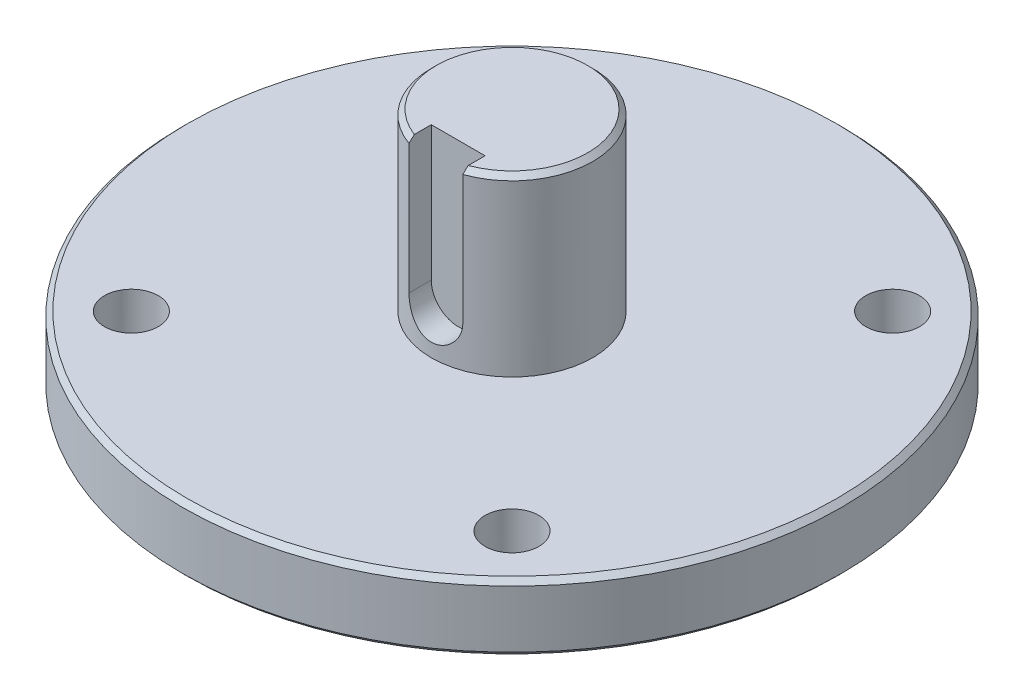
ISO-10303-21;
HEADER;
FILE_DESCRIPTION(('STEP AP214'),'2;1');
FILE_NAME('part.step','',(''),(''),'','','');
FILE_SCHEMA(('AUTOMOTIVE_DESIGN { 1 0 10303 214 1 1 1 1 }'));
ENDSEC;
DATA;
#1=APPLICATION_CONTEXT('core data for automotive mechanical design processes');
#2=APPLICATION_PROTOCOL_DEFINITION('international standard','automotive_design',2000,#1);
#3=PRODUCT_CONTEXT('',#1,'mechanical');
#4=PRODUCT('Part','Part','',(#3));
#5=PRODUCT_RELATED_PRODUCT_CATEGORY('part','',(#4));
#6=PRODUCT_DEFINITION_FORMATION('','',#4);
#7=PRODUCT_DEFINITION_CONTEXT('part definition',#1,'design');
#8=PRODUCT_DEFINITION('design','',#6,#7);
#9=PRODUCT_DEFINITION_SHAPE('','',#8);
#10=(LENGTH_UNIT() NAMED_UNIT(*) SI_UNIT(.MILLI.,.METRE.));
#11=(NAMED_UNIT(*) PLANE_ANGLE_UNIT() SI_UNIT($,.RADIAN.));
#12=(NAMED_UNIT(*) SI_UNIT($,.STERADIAN.) SOLID_ANGLE_UNIT());
#13=UNCERTAINTY_MEASURE_WITH_UNIT(LENGTH_MEASURE(1.E-05),#10,'distance_accuracy_value','');
#14=(GEOMETRIC_REPRESENTATION_CONTEXT(3) GLOBAL_UNCERTAINTY_ASSIGNED_CONTEXT((#13)) GLOBAL_UNIT_ASSIGNED_CONTEXT((#10,
#11,#12)) REPRESENTATION_CONTEXT('',''));
#15=CARTESIAN_POINT('',(0.,0.,0.));
#16=DIRECTION('',(0.,0.,1.));
#17=DIRECTION('',(1.,0.,0.));
#18=AXIS2_PLACEMENT_3D('',#15,#16,#17);
#19=CARTESIAN_POINT('',(0.,0.,0.));
#20=DIRECTION('',(0.,-1.,0.));
#21=DIRECTION('',(0.,0.,-1.));
#22=AXIS2_PLACEMENT_3D('',#19,#20,#21);
#23=PLANE('',#22);
#24=CARTESIAN_POINT('',(0.,0.,0.));
#25=DIRECTION('',(0.,-1.,0.));
#26=DIRECTION('',(0.,0.,-1.));
#27=AXIS2_PLACEMENT_3D('',#24,#25,#26);
#28=CIRCLE('',#27,48.25);
#29=CARTESIAN_POINT('',(0.,0.,-48.25));
#30=VERTEX_POINT('',#29);
#31=EDGE_CURVE('E42',#30,#30,#28,.T.);
#32=ORIENTED_EDGE('',*,*,#31,.T.);
#33=EDGE_LOOP('',(#32));
#34=FACE_BOUND('',#33,.T.);
#35=CARTESIAN_POINT('',(-28.2842712474619,0.,28.2842712474619));
#36=DIRECTION('',(0.,-1.,0.));
#37=DIRECTION('',(0.,0.,-1.));
#38=AXIS2_PLACEMENT_3D('',#35,#36,#37);
#39=CIRCLE('',#38,4.);
#40=CARTESIAN_POINT('',(-28.2842712474619,0.,24.2842712474619));
#41=VERTEX_POINT('',#40);
#42=EDGE_CURVE('E116',#41,#41,#39,.F.);
#43=ORIENTED_EDGE('',*,*,#42,.T.);
#44=EDGE_LOOP('',(#43));
#45=FACE_BOUND('',#44,.T.);
#46=CARTESIAN_POINT('',(28.2842712474619,0.,28.2842712474619));
#47=DIRECTION('',(0.,-1.,0.));
#48=DIRECTION('',(0.,0.,-1.));
#49=AXIS2_PLACEMENT_3D('',#46,#47,#48);
#50=CIRCLE('',#49,4.00000000000001);
#51=CARTESIAN_POINT('',(28.2842712474619,0.,24.2842712474619));
#52=VERTEX_POINT('',#51);
#53=EDGE_CURVE('E127',#52,#52,#50,.F.);
#54=ORIENTED_EDGE('',*,*,#53,.T.);
#55=EDGE_LOOP('',(#54));
#56=FACE_BOUND('',#55,.T.);
#57=CARTESIAN_POINT('',(28.2842712474619,0.,-28.2842712474619));
#58=DIRECTION('',(0.,-1.,0.));
#59=DIRECTION('',(0.,0.,-1.));
#60=AXIS2_PLACEMENT_3D('',#57,#58,#59);
#61=CIRCLE('',#60,4.00000000000001);
#62=CARTESIAN_POINT('',(28.2842712474619,0.,-32.2842712474619));
#63=VERTEX_POINT('',#62);
#64=EDGE_CURVE('E121',#63,#63,#61,.F.);
#65=ORIENTED_EDGE('',*,*,#64,.T.);
#66=EDGE_LOOP('',(#65));
#67=FACE_BOUND('',#66,.T.);
#68=CARTESIAN_POINT('',(-28.2842712474619,0.,-28.2842712474619));
#69=DIRECTION('',(0.,-1.,0.));
#70=DIRECTION('',(0.,0.,-1.));
#71=AXIS2_PLACEMENT_3D('',#68,#69,#70);
#72=CIRCLE('',#71,4.);
#73=CARTESIAN_POINT('',(-28.2842712474619,0.,-32.2842712474619));
#74=VERTEX_POINT('',#73);
#75=EDGE_CURVE('E120',#74,#74,#72,.F.);
#76=ORIENTED_EDGE('',*,*,#75,.T.);
#77=EDGE_LOOP('',(#76));
#78=FACE_BOUND('',#77,.T.);
#79=ADVANCED_FACE('F34',(#34,#45,#56,#67,#78),#23,.T.);
#80=CARTESIAN_POINT('',(0.,36.,0.));
#81=DIRECTION('',(0.,1.,0.));
#82=DIRECTION('',(0.,0.,1.));
#83=AXIS2_PLACEMENT_3D('',#80,#81,#82);
#84=CYLINDRICAL_SURFACE('',#83,49.);
#85=CARTESIAN_POINT('',(0.,0.749999999999987,0.));
#86=DIRECTION('',(0.,-1.,0.));
#87=DIRECTION('',(0.,0.,-1.));
#88=AXIS2_PLACEMENT_3D('',#85,#86,#87);
#89=CIRCLE('',#88,49.);
#90=CARTESIAN_POINT('',(0.,0.749999999999987,-49.));
#91=VERTEX_POINT('',#90);
#92=EDGE_CURVE('E192',#91,#91,#89,.F.);
#93=ORIENTED_EDGE('',*,*,#92,.T.);
#94=EDGE_LOOP('',(#93));
#95=FACE_BOUND('',#94,.T.);
#96=CARTESIAN_POINT('',(0.,9.25000000000002,0.));
#97=DIRECTION('',(0.,1.,0.));
#98=DIRECTION('',(0.,0.,1.));
#99=AXIS2_PLACEMENT_3D('',#96,#97,#98);
#100=CIRCLE('',#99,49.);
#101=CARTESIAN_POINT('',(0.,9.25000000000002,49.));
#102=VERTEX_POINT('',#101);
#103=EDGE_CURVE('E189',#102,#102,#100,.F.);
#104=ORIENTED_EDGE('',*,*,#103,.T.);
#105=EDGE_LOOP('',(#104));
#106=FACE_BOUND('',#105,.T.);
#107=ADVANCED_FACE('F203',(#95,#106),#84,.T.);
#108=CARTESIAN_POINT('',(-49.,10.,0.));
#109=DIRECTION('',(0.,1.,0.));
#110=DIRECTION('',(0.,0.,1.));
#111=AXIS2_PLACEMENT_3D('',#108,#109,#110);
#112=PLANE('',#111);
#113=CARTESIAN_POINT('',(0.,10.,0.));
#114=DIRECTION('',(0.,1.,0.));
#115=DIRECTION('',(0.,0.,1.));
#116=AXIS2_PLACEMENT_3D('',#113,#114,#115);
#117=CIRCLE('',#116,48.25);
#118=CARTESIAN_POINT('',(0.,10.,48.25));
#119=VERTEX_POINT('',#118);
#120=EDGE_CURVE('E11',#119,#119,#117,.T.);
#121=ORIENTED_EDGE('',*,*,#120,.T.);
#122=EDGE_LOOP('',(#121));
#123=FACE_BOUND('',#122,.T.);
#124=CARTESIAN_POINT('',(-28.2842712474619,10.,28.2842712474619));
#125=DIRECTION('',(0.,1.,0.));
#126=DIRECTION('',(0.,0.,1.));
#127=AXIS2_PLACEMENT_3D('',#124,#125,#126);
#128=CIRCLE('',#127,4.);
#129=CARTESIAN_POINT('',(-28.2842712474619,10.,32.2842712474619));
#130=VERTEX_POINT('',#129);
#131=EDGE_CURVE('E130',#130,#130,#128,.T.);
#132=ORIENTED_EDGE('',*,*,#131,.F.);
#133=EDGE_LOOP('',(#132));
#134=FACE_BOUND('',#133,.T.);
#135=CARTESIAN_POINT('',(28.2842712474619,10.,28.2842712474619));
#136=DIRECTION('',(0.,1.,0.));
#137=DIRECTION('',(0.,0.,1.));
#138=AXIS2_PLACEMENT_3D('',#135,#136,#137);
#139=CIRCLE('',#138,4.00000000000001);
#140=CARTESIAN_POINT('',(28.2842712474619,10.,32.2842712474619));
#141=VERTEX_POINT('',#140);
#142=EDGE_CURVE('E124',#141,#141,#139,.T.);
#143=ORIENTED_EDGE('',*,*,#142,.F.);
#144=EDGE_LOOP('',(#143));
#145=FACE_BOUND('',#144,.T.);
#146=CARTESIAN_POINT('',(28.2842712474619,10.,-28.2842712474619));
#147=DIRECTION('',(0.,1.,0.));
#148=DIRECTION('',(0.,0.,1.));
#149=AXIS2_PLACEMENT_3D('',#146,#147,#148);
#150=CIRCLE('',#149,4.00000000000001);
#151=CARTESIAN_POINT('',(28.2842712474619,10.,-24.2842712474619));
#152=VERTEX_POINT('',#151);
#153=EDGE_CURVE('E117',#152,#152,#150,.T.);
#154=ORIENTED_EDGE('',*,*,#153,.F.);
#155=EDGE_LOOP('',(#154));
#156=FACE_BOUND('',#155,.T.);
#157=CARTESIAN_POINT('',(-28.2842712474619,10.,-28.2842712474619));
#158=DIRECTION('',(0.,1.,0.));
#159=DIRECTION('',(0.,0.,1.));
#160=AXIS2_PLACEMENT_3D('',#157,#158,#159);
#161=CIRCLE('',#160,4.);
#162=CARTESIAN_POINT('',(-28.2842712474619,10.,-24.2842712474619));
#163=VERTEX_POINT('',#162);
#164=EDGE_CURVE('E135',#163,#163,#161,.T.);
#165=ORIENTED_EDGE('',*,*,#164,.F.);
#166=EDGE_LOOP('',(#165));
#167=FACE_BOUND('',#166,.T.);
#168=CARTESIAN_POINT('',(0.,10.,0.));
#169=DIRECTION('',(0.,1.,0.));
#170=DIRECTION('',(0.,0.,1.));
#171=AXIS2_PLACEMENT_3D('',#168,#169,#170);
#172=CIRCLE('',#171,12.);
#173=CARTESIAN_POINT('',(0.,10.,12.));
#174=VERTEX_POINT('',#173);
#175=EDGE_CURVE('E138',#174,#174,#172,.T.);
#176=ORIENTED_EDGE('',*,*,#175,.F.);
#177=EDGE_LOOP('',(#176));
#178=FACE_BOUND('',#177,.T.);
#179=ADVANCED_FACE('F206',(#123,#134,#145,#156,#167,#178),#112,.T.);
#180=CARTESIAN_POINT('',(0.,36.,0.));
#181=DIRECTION('',(0.,1.,0.));
#182=DIRECTION('',(0.,0.,1.));
#183=AXIS2_PLACEMENT_3D('',#180,#181,#182);
#184=CYLINDRICAL_SURFACE('',#183,12.);
#185=DIRECTION('',(0.,1.,0.));
#186=VECTOR('',#185,1.);
#187=CARTESIAN_POINT('',(-4.,36.,11.3137084989848));
#188=LINE('',#187,#186);
#189=CARTESIAN_POINT('',(-4.,35.25,11.3137084989848));
#190=VERTEX_POINT('',#189);
#191=CARTESIAN_POINT('',(-3.99999999999998,16.,11.3137084989848));
#192=VERTEX_POINT('',#191);
#193=EDGE_CURVE('E112',#190,#192,#188,.F.);
#194=ORIENTED_EDGE('',*,*,#193,.F.);
#195=CARTESIAN_POINT('',(0.,35.25,0.));
#196=DIRECTION('',(0.,1.,0.));
#197=DIRECTION('',(0.,0.,1.));
#198=AXIS2_PLACEMENT_3D('',#195,#196,#197);
#199=CIRCLE('',#198,12.);
#200=CARTESIAN_POINT('',(4.,35.25,11.3137084989848));
#201=VERTEX_POINT('',#200);
#202=EDGE_CURVE('E49',#190,#201,#199,.F.);
#203=ORIENTED_EDGE('',*,*,#202,.T.);
#204=DIRECTION('',(0.,1.,0.));
#205=VECTOR('',#204,1.);
#206=CARTESIAN_POINT('',(4.,36.,11.3137084989848));
#207=LINE('',#206,#205);
#208=CARTESIAN_POINT('',(4.00000000000001,16.,11.3137084989848));
#209=VERTEX_POINT('',#208);
#210=EDGE_CURVE('E114',#209,#201,#207,.T.);
#211=ORIENTED_EDGE('',*,*,#210,.F.);
#212=CARTESIAN_POINT('',(-3.99999999999997,16.,11.3137084989848));
#213=CARTESIAN_POINT('',(-4.00001438576648,15.8908686754875,11.3136910923705));
#214=CARTESIAN_POINT('',(-3.99553419554534,15.7817470805194,11.3152871024731));
#215=CARTESIAN_POINT('',(-3.97769673248749,15.5643503386412,11.3215763859361));
#216=CARTESIAN_POINT('',(-3.96434185595519,15.4560749712191,11.3262688232103));
#217=CARTESIAN_POINT('',(-3.92891935076471,15.2414552186327,11.3386032840401));
#218=CARTESIAN_POINT('',(-3.90687756421019,15.1351060759185,11.3462365576019));
#219=CARTESIAN_POINT('',(-3.85430689648185,14.9247867702676,11.364201918496));
#220=CARTESIAN_POINT('',(-3.82377770857631,14.8208166934565,11.3745341033653));
#221=CARTESIAN_POINT('',(-3.71986482089945,14.5136614724559,11.4091190527027));
#222=CARTESIAN_POINT('',(-3.63410266896584,14.314913348044,11.4369799021453));
#223=CARTESIAN_POINT('',(-3.43228454569817,13.9345971016626,11.4991525453999));
#224=CARTESIAN_POINT('',(-3.31620997228934,13.753039622767,11.5334682968154));
#225=CARTESIAN_POINT('',(-3.05220793355646,13.4051313544309,11.6061789182336));
#226=CARTESIAN_POINT('',(-2.90330055412138,13.2395437715106,11.6446750308563));
#227=CARTESIAN_POINT('',(-2.57995313902008,12.9351726348864,11.7205540276094));
#228=CARTESIAN_POINT('',(-2.40550856651353,12.796393854115,11.7579367125094));
#229=CARTESIAN_POINT('',(-2.03041476001122,12.5460828409488,11.8285552975691));
#230=CARTESIAN_POINT('',(-1.8292004049582,12.4353563067388,11.8616574966305));
#231=CARTESIAN_POINT('',(-1.40971695235369,12.2496307489778,11.9187843500282));
#232=CARTESIAN_POINT('',(-1.19145308844233,12.1746208113806,11.9428117769099));
#233=CARTESIAN_POINT('',(-0.752117395358838,12.0650571548386,11.9783628445804));
#234=CARTESIAN_POINT('',(-0.53140734642988,12.0291869149082,11.9902923605184));
#235=CARTESIAN_POINT('',(-0.0867958692352536,11.9947348007759,12.0017443351774));
#236=CARTESIAN_POINT('',(0.137104785886842,11.9961440416127,12.0012697502156));
#237=CARTESIAN_POINT('',(0.572415361032343,12.0353770952526,11.9882415502496));
#238=CARTESIAN_POINT('',(0.783970739663782,12.0717704013304,11.9761624577266));
#239=CARTESIAN_POINT('',(1.19777632834896,12.1775729452123,11.9418784019559));
#240=CARTESIAN_POINT('',(1.40002602175552,12.2469840137269,11.9196728772387));
#241=CARTESIAN_POINT('',(1.79261022537111,12.4176849060704,11.8670267992102));
#242=CARTESIAN_POINT('',(1.9827530213058,12.5193820306062,11.8364817702071));
#243=CARTESIAN_POINT('',(2.3436993579728,12.7514419560314,11.7703352504572));
#244=CARTESIAN_POINT('',(2.51449761883746,12.8818125545877,11.7347323851811));
#245=CARTESIAN_POINT('',(2.8403854431,13.1746757921845,11.6602518814889));
#246=CARTESIAN_POINT('',(2.99435951335511,13.3383901102989,11.6212989752184));
#247=CARTESIAN_POINT('',(3.27310303719345,13.6897980333458,11.5458957896576));
#248=CARTESIAN_POINT('',(3.39786305574727,13.8774993549997,11.5094463215614));
#249=CARTESIAN_POINT('',(3.56109757745217,14.1747129503772,11.4595759659792));
#250=CARTESIAN_POINT('',(3.61182358389816,14.2772554047675,11.4436484943195));
#251=CARTESIAN_POINT('',(3.70440095621129,14.4865649809563,11.4140167075143));
#252=CARTESIAN_POINT('',(3.7462560163639,14.5933303220756,11.4003114674865));
#253=CARTESIAN_POINT('',(3.82067426911566,14.8102170865665,11.3755873303494));
#254=CARTESIAN_POINT('',(3.85324757051518,14.9203347131041,11.3645655126343));
#255=CARTESIAN_POINT('',(3.90883841588793,15.1431681544474,11.3455648512893));
#256=CARTESIAN_POINT('',(3.93186032329113,15.2558827579618,11.3375846182867));
#257=CARTESIAN_POINT('',(3.96661962949785,15.4736424465508,11.3254693235584));
#258=CARTESIAN_POINT('',(3.97913375141092,15.5785495195786,11.3210705251979));
#259=CARTESIAN_POINT('',(3.99582494949884,15.7889683326998,11.3151843303776));
#260=CARTESIAN_POINT('',(4.00001278362334,15.8944791156679,11.3136931771535));
#261=CARTESIAN_POINT('',(4.00000000000001,16.,11.3137084989848));
#262=B_SPLINE_CURVE_WITH_KNOTS('',3,(#212,#213,#214,#215,#216,#217,#218,#219,#220,#221,#222,
#223,#224,#225,#226,#227,#228,#229,#230,#231,#232,#233,#234,#235,#236,#237,#238,#239,#240,#241,
#242,#243,#244,#245,#246,#247,#248,#249,#250,#251,#252,#253,#254,#255,#256,#257,#258,#259,#260,
#261),.UNSPECIFIED.,.F.,.F.,(4,2,2,2,2,2,2,2,2,2,2,2,2,2,2,2,2,2,2,2,2,2,2,2,4),(0.,
0.327273938941734,0.654459544677845,0.980679087086515,1.30691042048862,1.95841627077208,
2.61032287944837,3.28524582541423,3.96028882145702,4.65295094423118,5.34540127175221,
6.01376445600323,6.68196834813281,7.32396236553652,7.96599198323703,8.61646637994582,
9.26711789045785,9.94834778922912,10.6297973968768,10.9759539762201,11.3219661149517,
11.6675999574416,12.0130757272824,12.3299368411189,12.6463882889711),.UNSPECIFIED.);
#263=EDGE_CURVE('E143',#192,#209,#262,.T.);
#264=ORIENTED_EDGE('',*,*,#263,.F.);
#265=EDGE_LOOP('',(#194,#203,#211,#264));
#266=FACE_BOUND('',#265,.T.);
#267=ORIENTED_EDGE('',*,*,#175,.T.);
#268=EDGE_LOOP('',(#267));
#269=FACE_BOUND('',#268,.T.);
#270=ADVANCED_FACE('F152',(#266,#269),#184,.T.);
#271=CARTESIAN_POINT('',(-12.,36.,0.));
#272=DIRECTION('',(0.,1.,0.));
#273=DIRECTION('',(0.,0.,1.));
#274=AXIS2_PLACEMENT_3D('',#271,#272,#273);
#275=PLANE('',#274);
#276=DIRECTION('',(0.,0.,1.));
#277=VECTOR('',#276,1.);
#278=CARTESIAN_POINT('',(4.,36.,8.));
#279=LINE('',#278,#277);
#280=CARTESIAN_POINT('',(4.00000000000001,36.,8.));
#281=VERTEX_POINT('',#280);
#282=CARTESIAN_POINT('',(4.,36.,10.5148704224065));
#283=VERTEX_POINT('',#282);
#284=EDGE_CURVE('E105',#281,#283,#279,.T.);
#285=ORIENTED_EDGE('',*,*,#284,.T.);
#286=CARTESIAN_POINT('',(0.,36.,0.));
#287=DIRECTION('',(0.,1.,0.));
#288=DIRECTION('',(0.,0.,1.));
#289=AXIS2_PLACEMENT_3D('',#286,#287,#288);
#290=CIRCLE('',#289,11.25);
#291=CARTESIAN_POINT('',(-4.,36.,10.5148704224065));
#292=VERTEX_POINT('',#291);
#293=EDGE_CURVE('E104',#283,#292,#290,.T.);
#294=ORIENTED_EDGE('',*,*,#293,.T.);
#295=DIRECTION('',(0.,0.,1.));
#296=VECTOR('',#295,1.);
#297=CARTESIAN_POINT('',(-4.,36.,8.));
#298=LINE('',#297,#296);
#299=CARTESIAN_POINT('',(-4.,36.,8.));
#300=VERTEX_POINT('',#299);
#301=EDGE_CURVE('E84',#300,#292,#298,.T.);
#302=ORIENTED_EDGE('',*,*,#301,.F.);
#303=DIRECTION('',(-1.,0.,0.));
#304=VECTOR('',#303,1.);
#305=CARTESIAN_POINT('',(-4.,36.,8.));
#306=LINE('',#305,#304);
#307=EDGE_CURVE('E91',#281,#300,#306,.T.);
#308=ORIENTED_EDGE('',*,*,#307,.F.);
#309=EDGE_LOOP('',(#285,#294,#302,#308));
#310=FACE_BOUND('',#309,.T.);
#311=ADVANCED_FACE('F102',(#310),#275,.T.);
#312=CARTESIAN_POINT('',(-28.2842712474619,-0.0010000000000062,-28.2842712474619));
#313=DIRECTION('',(0.,1.,0.));
#314=DIRECTION('',(0.,0.,1.));
#315=AXIS2_PLACEMENT_3D('',#312,#313,#314);
#316=CYLINDRICAL_SURFACE('',#315,4.);
#317=ORIENTED_EDGE('',*,*,#75,.F.);
#318=EDGE_LOOP('',(#317));
#319=FACE_BOUND('',#318,.T.);
#320=ORIENTED_EDGE('',*,*,#164,.T.);
#321=EDGE_LOOP('',(#320));
#322=FACE_BOUND('',#321,.T.);
#323=ADVANCED_FACE('F229',(#319,#322),#316,.F.);
#324=CARTESIAN_POINT('',(28.2842712474619,-0.0010000000000062,-28.2842712474619));
#325=DIRECTION('',(0.,1.,0.));
#326=DIRECTION('',(0.,0.,1.));
#327=AXIS2_PLACEMENT_3D('',#324,#325,#326);
#328=CYLINDRICAL_SURFACE('',#327,4.00000000000001);
#329=ORIENTED_EDGE('',*,*,#64,.F.);
#330=EDGE_LOOP('',(#329));
#331=FACE_BOUND('',#330,.T.);
#332=ORIENTED_EDGE('',*,*,#153,.T.);
#333=EDGE_LOOP('',(#332));
#334=FACE_BOUND('',#333,.T.);
#335=ADVANCED_FACE('F318',(#331,#334),#328,.F.);
#336=CARTESIAN_POINT('',(28.2842712474619,-0.0010000000000062,28.2842712474619));
#337=DIRECTION('',(0.,1.,0.));
#338=DIRECTION('',(0.,0.,1.));
#339=AXIS2_PLACEMENT_3D('',#336,#337,#338);
#340=CYLINDRICAL_SURFACE('',#339,4.00000000000001);
#341=ORIENTED_EDGE('',*,*,#53,.F.);
#342=EDGE_LOOP('',(#341));
#343=FACE_BOUND('',#342,.T.);
#344=ORIENTED_EDGE('',*,*,#142,.T.);
#345=EDGE_LOOP('',(#344));
#346=FACE_BOUND('',#345,.T.);
#347=ADVANCED_FACE('F308',(#343,#346),#340,.F.);
#348=CARTESIAN_POINT('',(-28.2842712474619,-0.0010000000000062,28.2842712474619));
#349=DIRECTION('',(0.,1.,0.));
#350=DIRECTION('',(0.,0.,1.));
#351=AXIS2_PLACEMENT_3D('',#348,#349,#350);
#352=CYLINDRICAL_SURFACE('',#351,4.);
#353=ORIENTED_EDGE('',*,*,#42,.F.);
#354=EDGE_LOOP('',(#353));
#355=FACE_BOUND('',#354,.T.);
#356=ORIENTED_EDGE('',*,*,#131,.T.);
#357=EDGE_LOOP('',(#356));
#358=FACE_BOUND('',#357,.T.);
#359=ADVANCED_FACE('F263',(#355,#358),#352,.F.);
#360=CARTESIAN_POINT('',(4.,36.,8.));
#361=DIRECTION('',(1.,0.,0.));
#362=DIRECTION('',(0.,1.,0.));
#363=AXIS2_PLACEMENT_3D('',#360,#361,#362);
#364=PLANE('',#363);
#365=ORIENTED_EDGE('',*,*,#210,.T.);
#366=CARTESIAN_POINT('',(4.,35.25,11.3137084989848));
#367=CARTESIAN_POINT('',(4.,35.3752881960781,11.1808394058317));
#368=CARTESIAN_POINT('',(4.,35.5004322917608,11.0478350220612));
#369=CARTESIAN_POINT('',(4.,35.7504322917826,10.7815556632222));
#370=CARTESIAN_POINT('',(4.,35.8752881960999,10.6482806881333));
#371=CARTESIAN_POINT('',(4.,36.,10.5148704224065));
#372=B_SPLINE_CURVE_WITH_KNOTS('',3,(#366,#367,#368,#369,#370,#371),.UNSPECIFIED.,.F.,.F.,(4,2,
4),(0.,0.547869416081637,1.09573887357188),.UNSPECIFIED.);
#373=EDGE_CURVE('E183',#201,#283,#372,.T.);
#374=ORIENTED_EDGE('',*,*,#373,.T.);
#375=ORIENTED_EDGE('',*,*,#284,.F.);
#376=DIRECTION('',(0.,1.,0.));
#377=VECTOR('',#376,1.);
#378=CARTESIAN_POINT('',(4.,36.,8.));
#379=LINE('',#378,#377);
#380=CARTESIAN_POINT('',(4.00000000000001,16.,8.));
#381=VERTEX_POINT('',#380);
#382=EDGE_CURVE('E96',#381,#281,#379,.T.);
#383=ORIENTED_EDGE('',*,*,#382,.F.);
#384=DIRECTION('',(0.,0.,1.));
#385=VECTOR('',#384,1.);
#386=CARTESIAN_POINT('',(4.00000000000001,16.,8.));
#387=LINE('',#386,#385);
#388=EDGE_CURVE('E107',#381,#209,#387,.T.);
#389=ORIENTED_EDGE('',*,*,#388,.T.);
#390=EDGE_LOOP('',(#365,#374,#375,#383,#389));
#391=FACE_BOUND('',#390,.T.);
#392=ADVANCED_FACE('F161',(#391),#364,.F.);
#393=CARTESIAN_POINT('',(0.,16.,8.));
#394=DIRECTION('',(0.,0.,1.));
#395=DIRECTION('',(1.,0.,0.));
#396=AXIS2_PLACEMENT_3D('',#393,#394,#395);
#397=CYLINDRICAL_SURFACE('',#396,3.99999999999999);
#398=DIRECTION('',(0.,0.,1.));
#399=VECTOR('',#398,1.);
#400=CARTESIAN_POINT('',(-3.99999999999998,16.,8.));
#401=LINE('',#400,#399);
#402=CARTESIAN_POINT('',(-3.99999999999998,16.,8.));
#403=VERTEX_POINT('',#402);
#404=EDGE_CURVE('E86',#403,#192,#401,.T.);
#405=ORIENTED_EDGE('',*,*,#404,.T.);
#406=ORIENTED_EDGE('',*,*,#263,.T.);
#407=ORIENTED_EDGE('',*,*,#388,.F.);
#408=CARTESIAN_POINT('',(0.,16.,8.));
#409=DIRECTION('',(0.,0.,1.));
#410=DIRECTION('',(1.,0.,0.));
#411=AXIS2_PLACEMENT_3D('',#408,#409,#410);
#412=CIRCLE('',#411,3.99999999999999);
#413=EDGE_CURVE('E90',#403,#381,#412,.T.);
#414=ORIENTED_EDGE('',*,*,#413,.F.);
#415=EDGE_LOOP('',(#405,#406,#407,#414));
#416=FACE_BOUND('',#415,.T.);
#417=ADVANCED_FACE('F156',(#416),#397,.F.);
#418=CARTESIAN_POINT('',(-4.,36.,8.));
#419=DIRECTION('',(-1.,0.,0.));
#420=DIRECTION('',(0.,-1.,0.));
#421=AXIS2_PLACEMENT_3D('',#418,#419,#420);
#422=PLANE('',#421);
#423=ORIENTED_EDGE('',*,*,#301,.T.);
#424=CARTESIAN_POINT('',(-4.,36.,10.5148704224065));
#425=CARTESIAN_POINT('',(-4.,35.8752881960999,10.6482806881333));
#426=CARTESIAN_POINT('',(-4.,35.7504322917825,10.7815556632222));
#427=CARTESIAN_POINT('',(-4.,35.5004322917608,11.0478350220612));
#428=CARTESIAN_POINT('',(-4.,35.3752881960781,11.1808394058317));
#429=CARTESIAN_POINT('',(-4.,35.25,11.3137084989848));
#430=B_SPLINE_CURVE_WITH_KNOTS('',3,(#424,#425,#426,#427,#428,#429),.UNSPECIFIED.,.F.,.F.,(4,2,
4),(0.,0.547869457490248,1.09573887357188),.UNSPECIFIED.);
#431=EDGE_CURVE('E57',#292,#190,#430,.T.);
#432=ORIENTED_EDGE('',*,*,#431,.T.);
#433=ORIENTED_EDGE('',*,*,#193,.T.);
#434=ORIENTED_EDGE('',*,*,#404,.F.);
#435=DIRECTION('',(0.,-1.,0.));
#436=VECTOR('',#435,1.);
#437=CARTESIAN_POINT('',(-4.,36.,8.));
#438=LINE('',#437,#436);
#439=EDGE_CURVE('E80',#300,#403,#438,.T.);
#440=ORIENTED_EDGE('',*,*,#439,.F.);
#441=EDGE_LOOP('',(#423,#432,#433,#434,#440));
#442=FACE_BOUND('',#441,.T.);
#443=ADVANCED_FACE('F82',(#442),#422,.F.);
#444=CARTESIAN_POINT('',(0.,16.,8.));
#445=DIRECTION('',(0.,0.,1.));
#446=DIRECTION('',(1.,0.,0.));
#447=AXIS2_PLACEMENT_3D('',#444,#445,#446);
#448=PLANE('',#447);
#449=ORIENTED_EDGE('',*,*,#382,.T.);
#450=ORIENTED_EDGE('',*,*,#307,.T.);
#451=ORIENTED_EDGE('',*,*,#439,.T.);
#452=ORIENTED_EDGE('',*,*,#413,.T.);
#453=EDGE_LOOP('',(#449,#450,#451,#452));
#454=FACE_BOUND('',#453,.T.);
#455=ADVANCED_FACE('F94',(#454),#448,.T.);
#456=CARTESIAN_POINT('',(0.,36.,0.));
#457=DIRECTION('',(0.,-1.,0.));
#458=DIRECTION('',(0.,0.,-1.));
#459=AXIS2_PLACEMENT_3D('',#456,#457,#458);
#460=CONICAL_SURFACE('',#459,11.25,0.785398163397441);
#461=ORIENTED_EDGE('',*,*,#373,.F.);
#462=ORIENTED_EDGE('',*,*,#202,.F.);
#463=ORIENTED_EDGE('',*,*,#431,.F.);
#464=ORIENTED_EDGE('',*,*,#293,.F.);
#465=EDGE_LOOP('',(#461,#462,#463,#464));
#466=FACE_BOUND('',#465,.T.);
#467=ADVANCED_FACE('F175',(#466),#460,.T.);
#468=CARTESIAN_POINT('',(0.,0.749999999999987,0.));
#469=DIRECTION('',(0.,1.,0.));
#470=DIRECTION('',(0.,0.,1.));
#471=AXIS2_PLACEMENT_3D('',#468,#469,#470);
#472=CONICAL_SURFACE('',#471,49.,0.785398163397448);
#473=ORIENTED_EDGE('',*,*,#31,.F.);
#474=EDGE_LOOP('',(#473));
#475=FACE_BOUND('',#474,.T.);
#476=ORIENTED_EDGE('',*,*,#92,.F.);
#477=EDGE_LOOP('',(#476));
#478=FACE_BOUND('',#477,.T.);
#479=ADVANCED_FACE('F179',(#475,#478),#472,.T.);
#480=CARTESIAN_POINT('',(0.,10.,0.));
#481=DIRECTION('',(0.,-1.,0.));
#482=DIRECTION('',(0.,0.,-1.));
#483=AXIS2_PLACEMENT_3D('',#480,#481,#482);
#484=CONICAL_SURFACE('',#483,48.25,0.785398163397439);
#485=ORIENTED_EDGE('',*,*,#103,.F.);
#486=EDGE_LOOP('',(#485));
#487=FACE_BOUND('',#486,.T.);
#488=ORIENTED_EDGE('',*,*,#120,.F.);
#489=EDGE_LOOP('',(#488));
#490=FACE_BOUND('',#489,.T.);
#491=ADVANCED_FACE('F36',(#487,#490),#484,.T.);
#492=CLOSED_SHELL('',(#79,#107,#179,#270,#311,#323,#335,#347,#359,#392,#417,#443,#455,#467,#479,#491));
#493=MANIFOLD_SOLID_BREP('B2',#492);
#494=ADVANCED_BREP_SHAPE_REPRESENTATION('',(#18,#493),#14);
#495=SHAPE_DEFINITION_REPRESENTATION(#9,#494);
ENDSEC;
END-ISO-10303-21;
